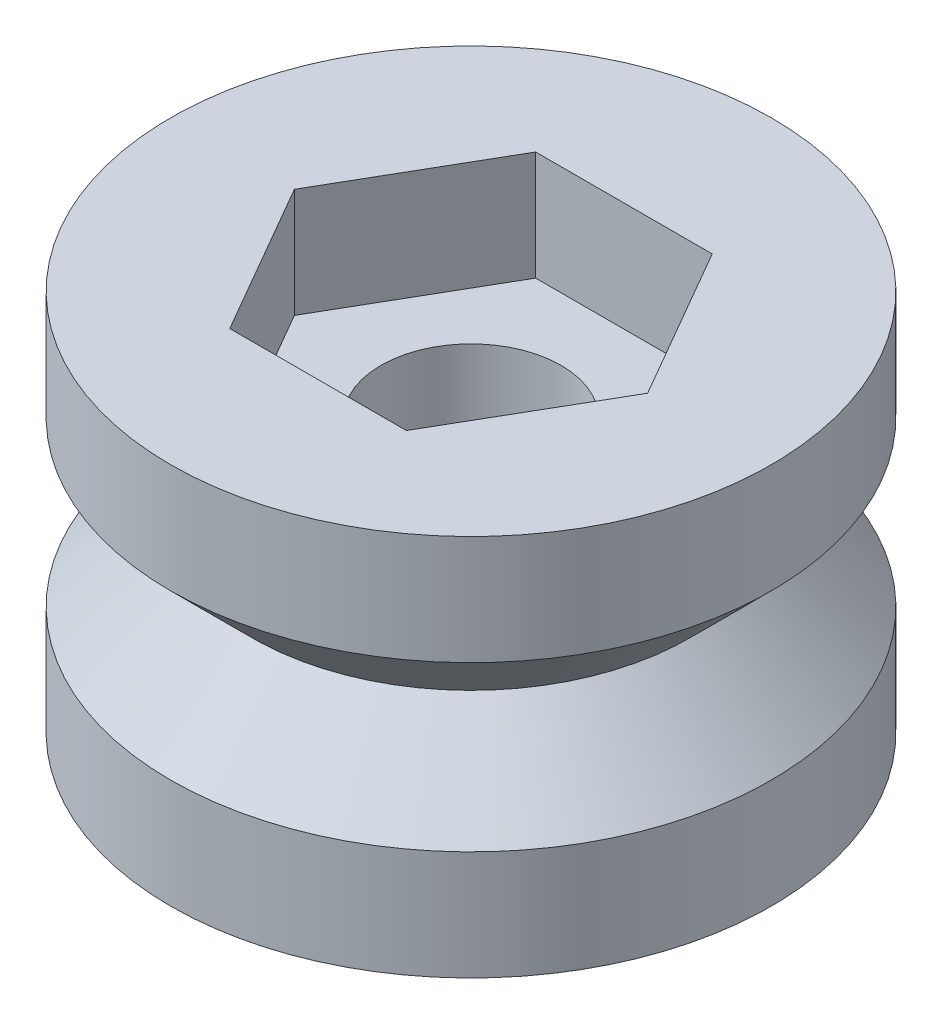
ISO-10303-21;
HEADER;
FILE_DESCRIPTION(('STEP AP214'),'2;1');
FILE_NAME('part.step','',(''),(''),'','','');
FILE_SCHEMA(('AUTOMOTIVE_DESIGN { 1 0 10303 214 1 1 1 1 }'));
ENDSEC;
DATA;
#1=APPLICATION_CONTEXT('core data for automotive mechanical design processes');
#2=APPLICATION_PROTOCOL_DEFINITION('international standard','automotive_design',2000,#1);
#3=PRODUCT_CONTEXT('',#1,'mechanical');
#4=PRODUCT('Part','Part','',(#3));
#5=PRODUCT_RELATED_PRODUCT_CATEGORY('part','',(#4));
#6=PRODUCT_DEFINITION_FORMATION('','',#4);
#7=PRODUCT_DEFINITION_CONTEXT('part definition',#1,'design');
#8=PRODUCT_DEFINITION('design','',#6,#7);
#9=PRODUCT_DEFINITION_SHAPE('','',#8);
#10=(LENGTH_UNIT() NAMED_UNIT(*) SI_UNIT(.MILLI.,.METRE.));
#11=(NAMED_UNIT(*) PLANE_ANGLE_UNIT() SI_UNIT($,.RADIAN.));
#12=(NAMED_UNIT(*) SI_UNIT($,.STERADIAN.) SOLID_ANGLE_UNIT());
#13=UNCERTAINTY_MEASURE_WITH_UNIT(LENGTH_MEASURE(1.E-05),#10,'distance_accuracy_value','');
#14=(GEOMETRIC_REPRESENTATION_CONTEXT(3) GLOBAL_UNCERTAINTY_ASSIGNED_CONTEXT((#13)) GLOBAL_UNIT_ASSIGNED_CONTEXT((#10,
#11,#12)) REPRESENTATION_CONTEXT('',''));
#15=CARTESIAN_POINT('',(0.,0.,0.));
#16=DIRECTION('',(0.,0.,1.));
#17=DIRECTION('',(1.,0.,0.));
#18=AXIS2_PLACEMENT_3D('',#15,#16,#17);
#19=CARTESIAN_POINT('',(0.,0.,0.));
#20=DIRECTION('',(0.,-1.,0.));
#21=DIRECTION('',(0.,0.,-1.));
#22=AXIS2_PLACEMENT_3D('',#19,#20,#21);
#23=CYLINDRICAL_SURFACE('',#22,1.65);
#24=CARTESIAN_POINT('',(0.,0.,0.));
#25=DIRECTION('',(0.,-1.,0.));
#26=DIRECTION('',(0.,0.,-1.));
#27=AXIS2_PLACEMENT_3D('',#24,#25,#26);
#28=CIRCLE('',#27,1.65);
#29=CARTESIAN_POINT('',(0.,0.,-1.65));
#30=VERTEX_POINT('',#29);
#31=EDGE_CURVE('E11',#30,#30,#28,.T.);
#32=ORIENTED_EDGE('',*,*,#31,.T.);
#33=EDGE_LOOP('',(#32));
#34=FACE_BOUND('',#33,.T.);
#35=CARTESIAN_POINT('',(0.,5.,0.));
#36=DIRECTION('',(0.,1.,0.));
#37=DIRECTION('',(0.,0.,1.));
#38=AXIS2_PLACEMENT_3D('',#35,#36,#37);
#39=CIRCLE('',#38,1.65);
#40=CARTESIAN_POINT('',(0.,5.,1.65));
#41=VERTEX_POINT('',#40);
#42=EDGE_CURVE('E36',#41,#41,#39,.T.);
#43=ORIENTED_EDGE('',*,*,#42,.T.);
#44=EDGE_LOOP('',(#43));
#45=FACE_BOUND('',#44,.T.);
#46=ADVANCED_FACE('F33',(#34,#45),#23,.F.);
#47=CARTESIAN_POINT('',(1.65,0.,0.));
#48=DIRECTION('',(0.,-1.,0.));
#49=DIRECTION('',(0.,0.,-1.));
#50=AXIS2_PLACEMENT_3D('',#47,#48,#49);
#51=PLANE('',#50);
#52=CARTESIAN_POINT('',(0.,0.,0.));
#53=DIRECTION('',(0.,-1.,0.));
#54=DIRECTION('',(0.,0.,-1.));
#55=AXIS2_PLACEMENT_3D('',#52,#53,#54);
#56=CIRCLE('',#55,5.5);
#57=CARTESIAN_POINT('',(0.,0.,-5.5));
#58=VERTEX_POINT('',#57);
#59=EDGE_CURVE('E41',#58,#58,#56,.T.);
#60=ORIENTED_EDGE('',*,*,#59,.T.);
#61=EDGE_LOOP('',(#60));
#62=FACE_BOUND('',#61,.T.);
#63=ORIENTED_EDGE('',*,*,#31,.F.);
#64=EDGE_LOOP('',(#63));
#65=FACE_BOUND('',#64,.T.);
#66=ADVANCED_FACE('F155',(#62,#65),#51,.T.);
#67=CARTESIAN_POINT('',(0.,0.,0.));
#68=DIRECTION('',(0.,-1.,0.));
#69=DIRECTION('',(0.,0.,-1.));
#70=AXIS2_PLACEMENT_3D('',#67,#68,#69);
#71=CYLINDRICAL_SURFACE('',#70,5.5);
#72=CARTESIAN_POINT('',(0.,2.,0.));
#73=DIRECTION('',(0.,-1.,0.));
#74=DIRECTION('',(0.,0.,-1.));
#75=AXIS2_PLACEMENT_3D('',#72,#73,#74);
#76=CIRCLE('',#75,5.5);
#77=CARTESIAN_POINT('',(0.,2.,-5.5));
#78=VERTEX_POINT('',#77);
#79=EDGE_CURVE('E149',#78,#78,#76,.T.);
#80=ORIENTED_EDGE('',*,*,#79,.T.);
#81=EDGE_LOOP('',(#80));
#82=FACE_BOUND('',#81,.T.);
#83=ORIENTED_EDGE('',*,*,#59,.F.);
#84=EDGE_LOOP('',(#83));
#85=FACE_BOUND('',#84,.T.);
#86=ADVANCED_FACE('F158',(#82,#85),#71,.T.);
#87=CARTESIAN_POINT('',(0.,2.,0.));
#88=DIRECTION('',(0.,-1.,0.));
#89=DIRECTION('',(0.,0.,-1.));
#90=AXIS2_PLACEMENT_3D('',#87,#88,#89);
#91=CONICAL_SURFACE('',#90,5.5,0.785398163397449);
#92=CARTESIAN_POINT('',(0.,3.5,0.));
#93=DIRECTION('',(0.,-1.,0.));
#94=DIRECTION('',(0.,0.,-1.));
#95=AXIS2_PLACEMENT_3D('',#92,#93,#94);
#96=CIRCLE('',#95,4.);
#97=CARTESIAN_POINT('',(0.,3.5,-4.));
#98=VERTEX_POINT('',#97);
#99=EDGE_CURVE('E146',#98,#98,#96,.T.);
#100=ORIENTED_EDGE('',*,*,#99,.T.);
#101=EDGE_LOOP('',(#100));
#102=FACE_BOUND('',#101,.T.);
#103=ORIENTED_EDGE('',*,*,#79,.F.);
#104=EDGE_LOOP('',(#103));
#105=FACE_BOUND('',#104,.T.);
#106=ADVANCED_FACE('F160',(#102,#105),#91,.T.);
#107=CARTESIAN_POINT('',(0.,3.5,0.));
#108=DIRECTION('',(0.,1.,0.));
#109=DIRECTION('',(0.,0.,1.));
#110=AXIS2_PLACEMENT_3D('',#107,#108,#109);
#111=CONICAL_SURFACE('',#110,4.,0.785398163397449);
#112=CARTESIAN_POINT('',(0.,5.,0.));
#113=DIRECTION('',(0.,-1.,0.));
#114=DIRECTION('',(0.,0.,-1.));
#115=AXIS2_PLACEMENT_3D('',#112,#113,#114);
#116=CIRCLE('',#115,5.5);
#117=CARTESIAN_POINT('',(0.,5.,-5.5));
#118=VERTEX_POINT('',#117);
#119=EDGE_CURVE('E143',#118,#118,#116,.T.);
#120=ORIENTED_EDGE('',*,*,#119,.T.);
#121=EDGE_LOOP('',(#120));
#122=FACE_BOUND('',#121,.T.);
#123=ORIENTED_EDGE('',*,*,#99,.F.);
#124=EDGE_LOOP('',(#123));
#125=FACE_BOUND('',#124,.T.);
#126=ADVANCED_FACE('F167',(#122,#125),#111,.T.);
#127=CARTESIAN_POINT('',(0.,0.,0.));
#128=DIRECTION('',(0.,-1.,0.));
#129=DIRECTION('',(0.,0.,-1.));
#130=AXIS2_PLACEMENT_3D('',#127,#128,#129);
#131=CYLINDRICAL_SURFACE('',#130,5.5);
#132=CARTESIAN_POINT('',(0.,7.,0.));
#133=DIRECTION('',(0.,-1.,0.));
#134=DIRECTION('',(0.,0.,-1.));
#135=AXIS2_PLACEMENT_3D('',#132,#133,#134);
#136=CIRCLE('',#135,5.5);
#137=CARTESIAN_POINT('',(0.,7.,-5.5));
#138=VERTEX_POINT('',#137);
#139=EDGE_CURVE('E140',#138,#138,#136,.T.);
#140=ORIENTED_EDGE('',*,*,#139,.T.);
#141=EDGE_LOOP('',(#140));
#142=FACE_BOUND('',#141,.T.);
#143=ORIENTED_EDGE('',*,*,#119,.F.);
#144=EDGE_LOOP('',(#143));
#145=FACE_BOUND('',#144,.T.);
#146=ADVANCED_FACE('F205',(#142,#145),#131,.T.);
#147=CARTESIAN_POINT('',(5.5,7.,0.));
#148=DIRECTION('',(0.,1.,0.));
#149=DIRECTION('',(0.,0.,1.));
#150=AXIS2_PLACEMENT_3D('',#147,#148,#149);
#151=PLANE('',#150);
#152=DIRECTION('',(0.5,0.,-0.866025403784439));
#153=VECTOR('',#152,1.);
#154=CARTESIAN_POINT('',(1.61658075373095,7.,2.8));
#155=LINE('',#154,#153);
#156=CARTESIAN_POINT('',(1.61658075373095,7.,2.8));
#157=VERTEX_POINT('',#156);
#158=CARTESIAN_POINT('',(3.2331615074619,7.,0.));
#159=VERTEX_POINT('',#158);
#160=EDGE_CURVE('E48',#157,#159,#155,.T.);
#161=ORIENTED_EDGE('',*,*,#160,.F.);
#162=DIRECTION('',(1.,0.,0.));
#163=VECTOR('',#162,1.);
#164=CARTESIAN_POINT('',(-1.61658075373095,7.,2.8));
#165=LINE('',#164,#163);
#166=CARTESIAN_POINT('',(-1.61658075373095,7.,2.8));
#167=VERTEX_POINT('',#166);
#168=EDGE_CURVE('E131',#167,#157,#165,.T.);
#169=ORIENTED_EDGE('',*,*,#168,.F.);
#170=DIRECTION('',(0.5,0.,0.866025403784439));
#171=VECTOR('',#170,1.);
#172=CARTESIAN_POINT('',(-3.2331615074619,7.,0.));
#173=LINE('',#172,#171);
#174=CARTESIAN_POINT('',(-3.2331615074619,7.,0.));
#175=VERTEX_POINT('',#174);
#176=EDGE_CURVE('E129',#175,#167,#173,.T.);
#177=ORIENTED_EDGE('',*,*,#176,.F.);
#178=DIRECTION('',(-0.5,0.,0.866025403784439));
#179=VECTOR('',#178,1.);
#180=CARTESIAN_POINT('',(-1.61658075373095,7.,-2.8));
#181=LINE('',#180,#179);
#182=CARTESIAN_POINT('',(-1.61658075373095,7.,-2.8));
#183=VERTEX_POINT('',#182);
#184=EDGE_CURVE('E96',#183,#175,#181,.T.);
#185=ORIENTED_EDGE('',*,*,#184,.F.);
#186=DIRECTION('',(-1.,0.,0.));
#187=VECTOR('',#186,1.);
#188=CARTESIAN_POINT('',(1.61658075373095,7.,-2.8));
#189=LINE('',#188,#187);
#190=CARTESIAN_POINT('',(1.61658075373095,7.,-2.8));
#191=VERTEX_POINT('',#190);
#192=EDGE_CURVE('E125',#191,#183,#189,.T.);
#193=ORIENTED_EDGE('',*,*,#192,.F.);
#194=DIRECTION('',(-0.5,0.,-0.866025403784439));
#195=VECTOR('',#194,1.);
#196=CARTESIAN_POINT('',(3.2331615074619,7.,0.));
#197=LINE('',#196,#195);
#198=EDGE_CURVE('E122',#159,#191,#197,.T.);
#199=ORIENTED_EDGE('',*,*,#198,.F.);
#200=EDGE_LOOP('',(#161,#169,#177,#185,#193,#199));
#201=FACE_BOUND('',#200,.T.);
#202=ORIENTED_EDGE('',*,*,#139,.F.);
#203=EDGE_LOOP('',(#202));
#204=FACE_BOUND('',#203,.T.);
#205=ADVANCED_FACE('F202',(#201,#204),#151,.T.);
#206=CARTESIAN_POINT('',(1.61658075373095,5.,2.8));
#207=DIRECTION('',(0.866025403784439,0.,0.5));
#208=DIRECTION('',(0.5,0.,-0.866025403784439));
#209=AXIS2_PLACEMENT_3D('',#206,#207,#208);
#210=PLANE('',#209);
#211=ORIENTED_EDGE('',*,*,#160,.T.);
#212=DIRECTION('',(0.,1.,0.));
#213=VECTOR('',#212,1.);
#214=CARTESIAN_POINT('',(3.2331615074619,5.,0.));
#215=LINE('',#214,#213);
#216=CARTESIAN_POINT('',(3.2331615074619,5.,0.));
#217=VERTEX_POINT('',#216);
#218=EDGE_CURVE('E78',#217,#159,#215,.T.);
#219=ORIENTED_EDGE('',*,*,#218,.F.);
#220=DIRECTION('',(0.5,0.,-0.866025403784439));
#221=VECTOR('',#220,1.);
#222=CARTESIAN_POINT('',(1.61658075373095,5.,2.8));
#223=LINE('',#222,#221);
#224=CARTESIAN_POINT('',(1.61658075373095,5.,2.8));
#225=VERTEX_POINT('',#224);
#226=EDGE_CURVE('E133',#225,#217,#223,.T.);
#227=ORIENTED_EDGE('',*,*,#226,.F.);
#228=DIRECTION('',(0.,1.,0.));
#229=VECTOR('',#228,1.);
#230=CARTESIAN_POINT('',(1.61658075373095,5.,2.8));
#231=LINE('',#230,#229);
#232=EDGE_CURVE('E56',#225,#157,#231,.T.);
#233=ORIENTED_EDGE('',*,*,#232,.T.);
#234=EDGE_LOOP('',(#211,#219,#227,#233));
#235=FACE_BOUND('',#234,.T.);
#236=ADVANCED_FACE('F192',(#235),#210,.F.);
#237=CARTESIAN_POINT('',(-1.61658075373095,5.,2.8));
#238=DIRECTION('',(0.,0.,1.));
#239=DIRECTION('',(1.,0.,0.));
#240=AXIS2_PLACEMENT_3D('',#237,#238,#239);
#241=PLANE('',#240);
#242=ORIENTED_EDGE('',*,*,#168,.T.);
#243=ORIENTED_EDGE('',*,*,#232,.F.);
#244=DIRECTION('',(1.,0.,0.));
#245=VECTOR('',#244,1.);
#246=CARTESIAN_POINT('',(-1.61658075373095,5.,2.8));
#247=LINE('',#246,#245);
#248=CARTESIAN_POINT('',(-1.61658075373095,5.,2.8));
#249=VERTEX_POINT('',#248);
#250=EDGE_CURVE('E108',#249,#225,#247,.T.);
#251=ORIENTED_EDGE('',*,*,#250,.F.);
#252=DIRECTION('',(0.,1.,0.));
#253=VECTOR('',#252,1.);
#254=CARTESIAN_POINT('',(-1.61658075373095,5.,2.8));
#255=LINE('',#254,#253);
#256=EDGE_CURVE('E100',#249,#167,#255,.T.);
#257=ORIENTED_EDGE('',*,*,#256,.T.);
#258=EDGE_LOOP('',(#242,#243,#251,#257));
#259=FACE_BOUND('',#258,.T.);
#260=ADVANCED_FACE('F189',(#259),#241,.F.);
#261=CARTESIAN_POINT('',(-3.2331615074619,5.,0.));
#262=DIRECTION('',(-0.866025403784439,0.,0.5));
#263=DIRECTION('',(0.5,0.,0.866025403784439));
#264=AXIS2_PLACEMENT_3D('',#261,#262,#263);
#265=PLANE('',#264);
#266=ORIENTED_EDGE('',*,*,#176,.T.);
#267=ORIENTED_EDGE('',*,*,#256,.F.);
#268=DIRECTION('',(0.5,0.,0.866025403784439));
#269=VECTOR('',#268,1.);
#270=CARTESIAN_POINT('',(-3.2331615074619,5.,0.));
#271=LINE('',#270,#269);
#272=CARTESIAN_POINT('',(-3.2331615074619,5.,0.));
#273=VERTEX_POINT('',#272);
#274=EDGE_CURVE('E104',#273,#249,#271,.T.);
#275=ORIENTED_EDGE('',*,*,#274,.F.);
#276=DIRECTION('',(0.,1.,0.));
#277=VECTOR('',#276,1.);
#278=CARTESIAN_POINT('',(-3.2331615074619,5.,0.));
#279=LINE('',#278,#277);
#280=EDGE_CURVE('E89',#273,#175,#279,.T.);
#281=ORIENTED_EDGE('',*,*,#280,.T.);
#282=EDGE_LOOP('',(#266,#267,#275,#281));
#283=FACE_BOUND('',#282,.T.);
#284=ADVANCED_FACE('F105',(#283),#265,.F.);
#285=CARTESIAN_POINT('',(-1.61658075373095,5.,-2.8));
#286=DIRECTION('',(-0.866025403784439,0.,-0.5));
#287=DIRECTION('',(-0.5,0.,0.866025403784439));
#288=AXIS2_PLACEMENT_3D('',#285,#286,#287);
#289=PLANE('',#288);
#290=ORIENTED_EDGE('',*,*,#184,.T.);
#291=ORIENTED_EDGE('',*,*,#280,.F.);
#292=DIRECTION('',(-0.5,0.,0.866025403784439));
#293=VECTOR('',#292,1.);
#294=CARTESIAN_POINT('',(-1.61658075373095,5.,-2.8));
#295=LINE('',#294,#293);
#296=CARTESIAN_POINT('',(-1.61658075373095,5.,-2.8));
#297=VERTEX_POINT('',#296);
#298=EDGE_CURVE('E93',#297,#273,#295,.T.);
#299=ORIENTED_EDGE('',*,*,#298,.F.);
#300=DIRECTION('',(0.,1.,0.));
#301=VECTOR('',#300,1.);
#302=CARTESIAN_POINT('',(-1.61658075373095,5.,-2.8));
#303=LINE('',#302,#301);
#304=EDGE_CURVE('E101',#297,#183,#303,.T.);
#305=ORIENTED_EDGE('',*,*,#304,.T.);
#306=EDGE_LOOP('',(#290,#291,#299,#305));
#307=FACE_BOUND('',#306,.T.);
#308=ADVANCED_FACE('F91',(#307),#289,.F.);
#309=CARTESIAN_POINT('',(1.61658075373095,5.,-2.8));
#310=DIRECTION('',(0.,0.,-1.));
#311=DIRECTION('',(-1.,0.,0.));
#312=AXIS2_PLACEMENT_3D('',#309,#310,#311);
#313=PLANE('',#312);
#314=ORIENTED_EDGE('',*,*,#192,.T.);
#315=ORIENTED_EDGE('',*,*,#304,.F.);
#316=DIRECTION('',(-1.,0.,0.));
#317=VECTOR('',#316,1.);
#318=CARTESIAN_POINT('',(1.61658075373095,5.,-2.8));
#319=LINE('',#318,#317);
#320=CARTESIAN_POINT('',(1.61658075373095,5.,-2.8));
#321=VERTEX_POINT('',#320);
#322=EDGE_CURVE('E114',#321,#297,#319,.T.);
#323=ORIENTED_EDGE('',*,*,#322,.F.);
#324=DIRECTION('',(0.,1.,0.));
#325=VECTOR('',#324,1.);
#326=CARTESIAN_POINT('',(1.61658075373095,5.,-2.8));
#327=LINE('',#326,#325);
#328=EDGE_CURVE('E137',#321,#191,#327,.T.);
#329=ORIENTED_EDGE('',*,*,#328,.T.);
#330=EDGE_LOOP('',(#314,#315,#323,#329));
#331=FACE_BOUND('',#330,.T.);
#332=ADVANCED_FACE('F185',(#331),#313,.F.);
#333=CARTESIAN_POINT('',(3.2331615074619,5.,0.));
#334=DIRECTION('',(0.866025403784439,0.,-0.5));
#335=DIRECTION('',(-0.5,0.,-0.866025403784439));
#336=AXIS2_PLACEMENT_3D('',#333,#334,#335);
#337=PLANE('',#336);
#338=ORIENTED_EDGE('',*,*,#198,.T.);
#339=ORIENTED_EDGE('',*,*,#328,.F.);
#340=DIRECTION('',(-0.5,0.,-0.866025403784439));
#341=VECTOR('',#340,1.);
#342=CARTESIAN_POINT('',(3.2331615074619,5.,0.));
#343=LINE('',#342,#341);
#344=EDGE_CURVE('E116',#217,#321,#343,.T.);
#345=ORIENTED_EDGE('',*,*,#344,.F.);
#346=ORIENTED_EDGE('',*,*,#218,.T.);
#347=EDGE_LOOP('',(#338,#339,#345,#346));
#348=FACE_BOUND('',#347,.T.);
#349=ADVANCED_FACE('F180',(#348),#337,.F.);
#350=CARTESIAN_POINT('',(0.,5.,0.));
#351=DIRECTION('',(0.,1.,0.));
#352=DIRECTION('',(0.,0.,1.));
#353=AXIS2_PLACEMENT_3D('',#350,#351,#352);
#354=PLANE('',#353);
#355=ORIENTED_EDGE('',*,*,#42,.F.);
#356=EDGE_LOOP('',(#355));
#357=FACE_BOUND('',#356,.T.);
#358=ORIENTED_EDGE('',*,*,#226,.T.);
#359=ORIENTED_EDGE('',*,*,#344,.T.);
#360=ORIENTED_EDGE('',*,*,#322,.T.);
#361=ORIENTED_EDGE('',*,*,#298,.T.);
#362=ORIENTED_EDGE('',*,*,#274,.T.);
#363=ORIENTED_EDGE('',*,*,#250,.T.);
#364=EDGE_LOOP('',(#358,#359,#360,#361,#362,#363));
#365=FACE_BOUND('',#364,.T.);
#366=ADVANCED_FACE('F111',(#357,#365),#354,.T.);
#367=CLOSED_SHELL('',(#46,#66,#86,#106,#126,#146,#205,#236,#260,#284,#308,#332,#349,#366));
#368=MANIFOLD_SOLID_BREP('B2',#367);
#369=ADVANCED_BREP_SHAPE_REPRESENTATION('',(#18,#368),#14);
#370=SHAPE_DEFINITION_REPRESENTATION(#9,#369);
ENDSEC;
END-ISO-10303-21;
